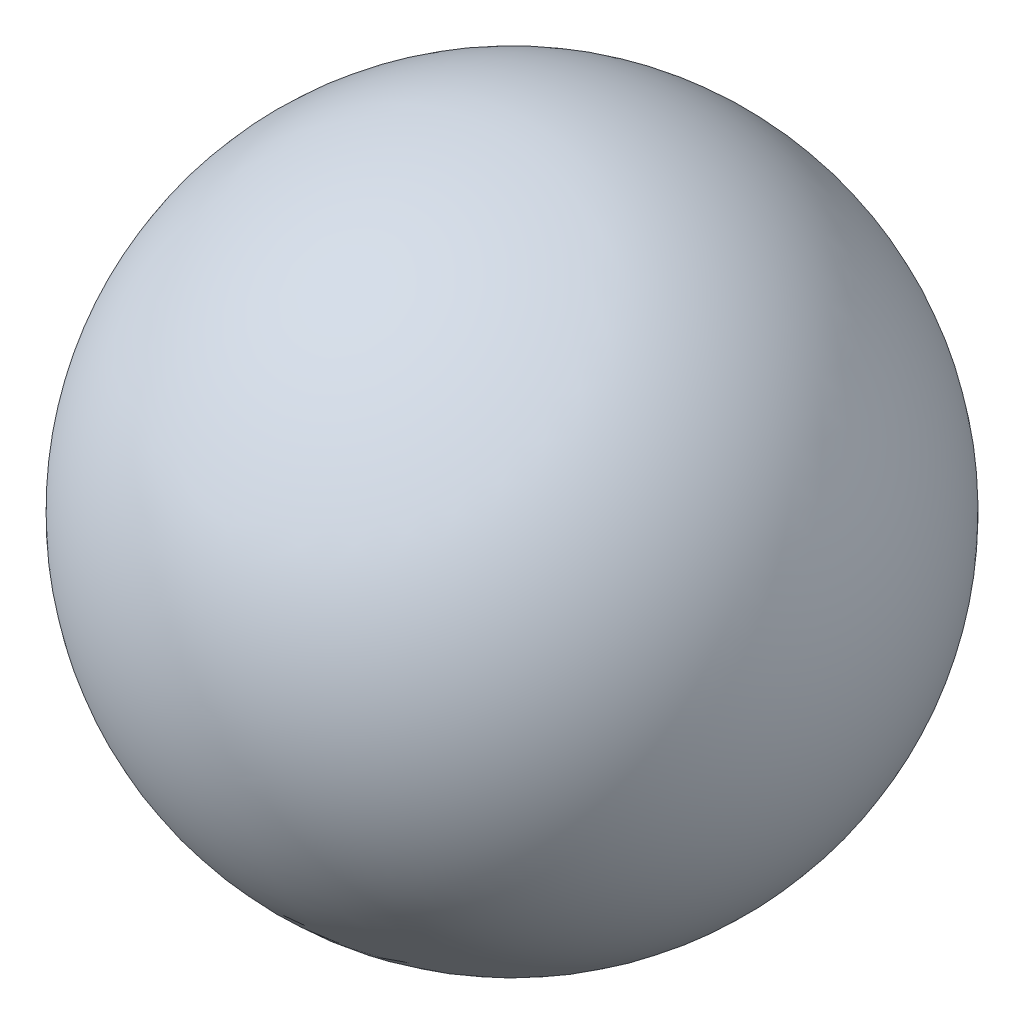
ISO-10303-21;
HEADER;
FILE_DESCRIPTION(('STEP AP214'),'2;1');
FILE_NAME('part.step','',(''),(''),'','','');
FILE_SCHEMA(('AUTOMOTIVE_DESIGN { 1 0 10303 214 1 1 1 1 }'));
ENDSEC;
DATA;
#1=APPLICATION_CONTEXT('core data for automotive mechanical design processes');
#2=APPLICATION_PROTOCOL_DEFINITION('international standard','automotive_design',2000,#1);
#3=PRODUCT_CONTEXT('',#1,'mechanical');
#4=PRODUCT('Part','Part','',(#3));
#5=PRODUCT_RELATED_PRODUCT_CATEGORY('part','',(#4));
#6=PRODUCT_DEFINITION_FORMATION('','',#4);
#7=PRODUCT_DEFINITION_CONTEXT('part definition',#1,'design');
#8=PRODUCT_DEFINITION('design','',#6,#7);
#9=PRODUCT_DEFINITION_SHAPE('','',#8);
#10=(LENGTH_UNIT() NAMED_UNIT(*) SI_UNIT(.MILLI.,.METRE.));
#11=(NAMED_UNIT(*) PLANE_ANGLE_UNIT() SI_UNIT($,.RADIAN.));
#12=(NAMED_UNIT(*) SI_UNIT($,.STERADIAN.) SOLID_ANGLE_UNIT());
#13=UNCERTAINTY_MEASURE_WITH_UNIT(LENGTH_MEASURE(1.E-05),#10,'distance_accuracy_value','');
#14=(GEOMETRIC_REPRESENTATION_CONTEXT(3) GLOBAL_UNCERTAINTY_ASSIGNED_CONTEXT((#13)) GLOBAL_UNIT_ASSIGNED_CONTEXT((#10,
#11,#12)) REPRESENTATION_CONTEXT('',''));
#15=CARTESIAN_POINT('',(0.,0.,0.));
#16=DIRECTION('',(0.,0.,1.));
#17=DIRECTION('',(1.,0.,0.));
#18=AXIS2_PLACEMENT_3D('',#15,#16,#17);
#19=CARTESIAN_POINT('',(64.16,43.3154351678161,54.2012339824724));
#20=DIRECTION('',(0.,0.624294642316075,0.781188965344138));
#21=DIRECTION('',(0.173648177666934,-0.769320949638491,0.614810203916853));
#22=AXIS2_PLACEMENT_3D('',#19,#20,#21);
#23=SPHERICAL_SURFACE('',#22,7.15);
#24=CARTESIAN_POINT('',(64.16,47.779141860376,59.786735084683));
#25=VERTEX_POINT('',#24);
#26=VERTEX_LOOP('',#25);
#27=FACE_BOUND('',#26,.T.);
#28=CARTESIAN_POINT('',(64.16,38.8517284752562,48.6157328802618));
#29=VERTEX_POINT('',#28);
#30=VERTEX_LOOP('',#29);
#31=FACE_BOUND('',#30,.T.);
#32=ADVANCED_FACE('F15',(#27,#31),#23,.T.);
#33=CLOSED_SHELL('',(#32));
#34=MANIFOLD_SOLID_BREP('B1',#33);
#35=ADVANCED_BREP_SHAPE_REPRESENTATION('',(#18,#34),#14);
#36=SHAPE_DEFINITION_REPRESENTATION(#9,#35);
ENDSEC;
END-ISO-10303-21;
